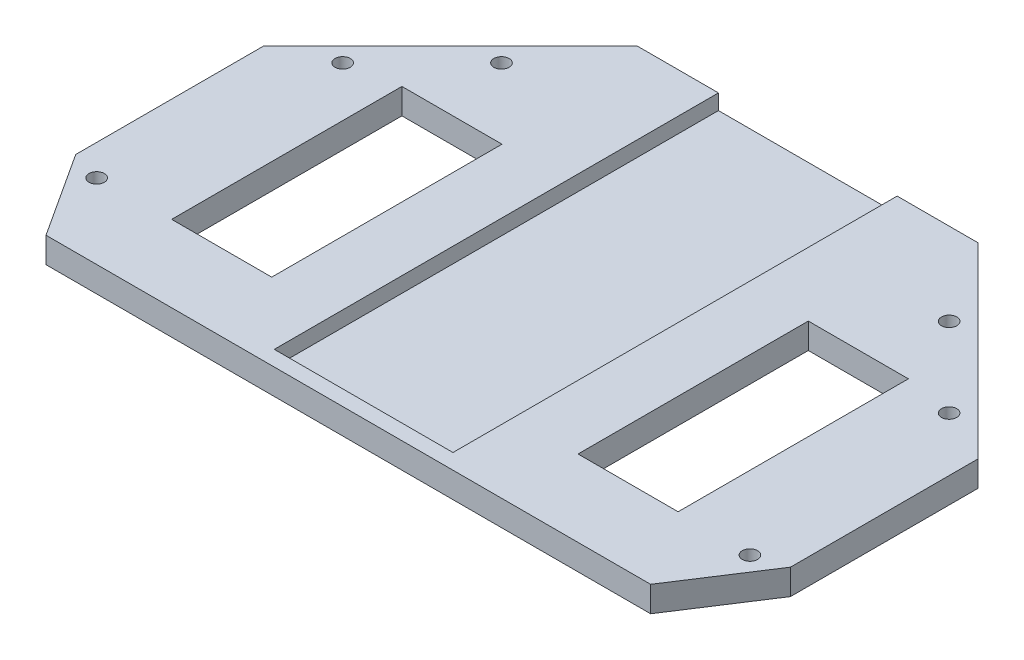
ISO-10303-21;
HEADER;
FILE_DESCRIPTION(('STEP AP214'),'2;1');
FILE_NAME('part.step','',(''),(''),'','','');
FILE_SCHEMA(('AUTOMOTIVE_DESIGN { 1 0 10303 214 1 1 1 1 }'));
ENDSEC;
DATA;
#1=APPLICATION_CONTEXT('core data for automotive mechanical design processes');
#2=APPLICATION_PROTOCOL_DEFINITION('international standard','automotive_design',2000,#1);
#3=PRODUCT_CONTEXT('',#1,'mechanical');
#4=PRODUCT('Part','Part','',(#3));
#5=PRODUCT_RELATED_PRODUCT_CATEGORY('part','',(#4));
#6=PRODUCT_DEFINITION_FORMATION('','',#4);
#7=PRODUCT_DEFINITION_CONTEXT('part definition',#1,'design');
#8=PRODUCT_DEFINITION('design','',#6,#7);
#9=PRODUCT_DEFINITION_SHAPE('','',#8);
#10=(LENGTH_UNIT() NAMED_UNIT(*) SI_UNIT(.MILLI.,.METRE.));
#11=(NAMED_UNIT(*) PLANE_ANGLE_UNIT() SI_UNIT($,.RADIAN.));
#12=(NAMED_UNIT(*) SI_UNIT($,.STERADIAN.) SOLID_ANGLE_UNIT());
#13=UNCERTAINTY_MEASURE_WITH_UNIT(LENGTH_MEASURE(1.E-05),#10,'distance_accuracy_value','');
#14=(GEOMETRIC_REPRESENTATION_CONTEXT(3) GLOBAL_UNCERTAINTY_ASSIGNED_CONTEXT((#13)) GLOBAL_UNIT_ASSIGNED_CONTEXT((#10,
#11,#12)) REPRESENTATION_CONTEXT('',''));
#15=CARTESIAN_POINT('',(0.,0.,0.));
#16=DIRECTION('',(0.,0.,1.));
#17=DIRECTION('',(1.,0.,0.));
#18=AXIS2_PLACEMENT_3D('',#15,#16,#17);
#19=CARTESIAN_POINT('',(0.,5.,0.));
#20=DIRECTION('',(0.,-1.,0.));
#21=DIRECTION('',(0.,0.,-1.));
#22=AXIS2_PLACEMENT_3D('',#19,#20,#21);
#23=PLANE('',#22);
#24=CARTESIAN_POINT('',(-59.3969696196701,5.,-28.2842712474616));
#25=DIRECTION('',(0.,1.,0.));
#26=DIRECTION('',(0.,0.,1.));
#27=AXIS2_PLACEMENT_3D('',#24,#25,#26);
#28=CIRCLE('',#27,1.50000000000001);
#29=CARTESIAN_POINT('',(-59.3969696196701,5.,-26.7842712474616));
#30=VERTEX_POINT('',#29);
#31=EDGE_CURVE('E290',#30,#30,#28,.T.);
#32=ORIENTED_EDGE('',*,*,#31,.F.);
#33=EDGE_LOOP('',(#32));
#34=FACE_BOUND('',#33,.T.);
#35=DIRECTION('',(0.,0.,1.));
#36=VECTOR('',#35,1.);
#37=CARTESIAN_POINT('',(-49.6,5.,-30.1));
#38=LINE('',#37,#36);
#39=CARTESIAN_POINT('',(-49.6,5.,-30.1));
#40=VERTEX_POINT('',#39);
#41=CARTESIAN_POINT('',(-49.6,5.,15.));
#42=VERTEX_POINT('',#41);
#43=EDGE_CURVE('E302',#40,#42,#38,.T.);
#44=ORIENTED_EDGE('',*,*,#43,.F.);
#45=DIRECTION('',(-1.,0.,0.));
#46=VECTOR('',#45,1.);
#47=CARTESIAN_POINT('',(-49.6,5.,-30.1));
#48=LINE('',#47,#46);
#49=CARTESIAN_POINT('',(-30.,5.,-30.1));
#50=VERTEX_POINT('',#49);
#51=EDGE_CURVE('E309',#50,#40,#48,.T.);
#52=ORIENTED_EDGE('',*,*,#51,.F.);
#53=DIRECTION('',(0.,0.,-1.));
#54=VECTOR('',#53,1.);
#55=CARTESIAN_POINT('',(-30.,5.,-30.1));
#56=LINE('',#55,#54);
#57=CARTESIAN_POINT('',(-30.,5.,15.));
#58=VERTEX_POINT('',#57);
#59=EDGE_CURVE('E307',#58,#50,#56,.T.);
#60=ORIENTED_EDGE('',*,*,#59,.F.);
#61=DIRECTION('',(1.,0.,0.));
#62=VECTOR('',#61,1.);
#63=CARTESIAN_POINT('',(-49.6,5.,15.));
#64=LINE('',#63,#62);
#65=EDGE_CURVE('E304',#42,#58,#64,.T.);
#66=ORIENTED_EDGE('',*,*,#65,.F.);
#67=EDGE_LOOP('',(#44,#52,#60,#66));
#68=FACE_BOUND('',#67,.T.);
#69=DIRECTION('',(1.,0.,0.));
#70=VECTOR('',#69,1.);
#71=CARTESIAN_POINT('',(-17.5,5.,27.));
#72=LINE('',#71,#70);
#73=CARTESIAN_POINT('',(-17.5,5.,27.));
#74=VERTEX_POINT('',#73);
#75=CARTESIAN_POINT('',(17.5,5.,27.));
#76=VERTEX_POINT('',#75);
#77=EDGE_CURVE('E192',#74,#76,#72,.T.);
#78=ORIENTED_EDGE('',*,*,#77,.F.);
#79=DIRECTION('',(0.,0.,1.));
#80=VECTOR('',#79,1.);
#81=CARTESIAN_POINT('',(-17.5,5.,-60.));
#82=LINE('',#81,#80);
#83=CARTESIAN_POINT('',(-17.5,5.,-60.));
#84=VERTEX_POINT('',#83);
#85=EDGE_CURVE('E177',#84,#74,#82,.T.);
#86=ORIENTED_EDGE('',*,*,#85,.F.);
#87=DIRECTION('',(-1.,0.,0.));
#88=VECTOR('',#87,1.);
#89=CARTESIAN_POINT('',(-33.3380951166243,5.,-60.));
#90=LINE('',#89,#88);
#91=CARTESIAN_POINT('',(-33.3380951166243,5.,-60.));
#92=VERTEX_POINT('',#91);
#93=EDGE_CURVE('E333',#84,#92,#90,.T.);
#94=ORIENTED_EDGE('',*,*,#93,.T.);
#95=DIRECTION('',(-0.707106781186543,0.,0.707106781186552));
#96=VECTOR('',#95,1.);
#97=CARTESIAN_POINT('',(-70.,5.,-23.3380951166239));
#98=LINE('',#97,#96);
#99=CARTESIAN_POINT('',(-70.,5.,-23.3380951166239));
#100=VERTEX_POINT('',#99);
#101=EDGE_CURVE('E338',#92,#100,#98,.T.);
#102=ORIENTED_EDGE('',*,*,#101,.T.);
#103=DIRECTION('',(0.,0.,1.));
#104=VECTOR('',#103,1.);
#105=CARTESIAN_POINT('',(-70.,5.,13.3906308122387));
#106=LINE('',#105,#104);
#107=CARTESIAN_POINT('',(-70.,5.,13.3906308122387));
#108=VERTEX_POINT('',#107);
#109=EDGE_CURVE('E340',#100,#108,#106,.T.);
#110=ORIENTED_EDGE('',*,*,#109,.T.);
#111=DIRECTION('',(0.544639035015023,0.,0.838670567945427));
#112=VECTOR('',#111,1.);
#113=CARTESIAN_POINT('',(-59.2137495312472,5.,30.));
#114=LINE('',#113,#112);
#115=CARTESIAN_POINT('',(-59.2137495312472,5.,30.));
#116=VERTEX_POINT('',#115);
#117=EDGE_CURVE('E342',#108,#116,#114,.T.);
#118=ORIENTED_EDGE('',*,*,#117,.T.);
#119=DIRECTION('',(1.,0.,0.));
#120=VECTOR('',#119,1.);
#121=CARTESIAN_POINT('',(0.,5.,30.));
#122=LINE('',#121,#120);
#123=CARTESIAN_POINT('',(59.2137495312472,5.,30.));
#124=VERTEX_POINT('',#123);
#125=EDGE_CURVE('E331',#116,#124,#122,.T.);
#126=ORIENTED_EDGE('',*,*,#125,.T.);
#127=DIRECTION('',(-0.544639035015023,0.,0.838670567945427));
#128=VECTOR('',#127,1.);
#129=CARTESIAN_POINT('',(59.2137495312472,5.,30.));
#130=LINE('',#129,#128);
#131=CARTESIAN_POINT('',(70.,5.,13.3906308122387));
#132=VERTEX_POINT('',#131);
#133=EDGE_CURVE('E256',#132,#124,#130,.T.);
#134=ORIENTED_EDGE('',*,*,#133,.F.);
#135=DIRECTION('',(0.,0.,1.));
#136=VECTOR('',#135,1.);
#137=CARTESIAN_POINT('',(70.,5.,13.3906308122387));
#138=LINE('',#137,#136);
#139=CARTESIAN_POINT('',(70.,5.,-23.3380951166239));
#140=VERTEX_POINT('',#139);
#141=EDGE_CURVE('E259',#140,#132,#138,.T.);
#142=ORIENTED_EDGE('',*,*,#141,.F.);
#143=DIRECTION('',(0.707106781186543,0.,0.707106781186552));
#144=VECTOR('',#143,1.);
#145=CARTESIAN_POINT('',(70.,5.,-23.3380951166239));
#146=LINE('',#145,#144);
#147=CARTESIAN_POINT('',(33.3380951166243,5.,-60.));
#148=VERTEX_POINT('',#147);
#149=EDGE_CURVE('E263',#148,#140,#146,.T.);
#150=ORIENTED_EDGE('',*,*,#149,.F.);
#151=CARTESIAN_POINT('',(17.5,5.,-60.));
#152=VERTEX_POINT('',#151);
#153=EDGE_CURVE('E335',#148,#152,#90,.T.);
#154=ORIENTED_EDGE('',*,*,#153,.T.);
#155=DIRECTION('',(0.,0.,-1.));
#156=VECTOR('',#155,1.);
#157=CARTESIAN_POINT('',(17.5,5.,-60.));
#158=LINE('',#157,#156);
#159=EDGE_CURVE('E190',#76,#152,#158,.T.);
#160=ORIENTED_EDGE('',*,*,#159,.F.);
#161=EDGE_LOOP('',(#78,#86,#94,#102,#110,#118,#126,#134,#142,#150,#154,#160));
#162=FACE_BOUND('',#161,.T.);
#163=CARTESIAN_POINT('',(-43.8406204335662,5.,-43.8406204335657));
#164=DIRECTION('',(0.,1.,0.));
#165=DIRECTION('',(0.,0.,1.));
#166=AXIS2_PLACEMENT_3D('',#163,#164,#165);
#167=CIRCLE('',#166,1.50000000000001);
#168=CARTESIAN_POINT('',(-43.8406204335662,5.,-42.3406204335657));
#169=VERTEX_POINT('',#168);
#170=EDGE_CURVE('E296',#169,#169,#167,.T.);
#171=ORIENTED_EDGE('',*,*,#170,.F.);
#172=EDGE_LOOP('',(#171));
#173=FACE_BOUND('',#172,.T.);
#174=CARTESIAN_POINT('',(-63.979633982947,5.,15.316867676132));
#175=DIRECTION('',(0.,1.,0.));
#176=DIRECTION('',(0.,0.,1.));
#177=AXIS2_PLACEMENT_3D('',#174,#175,#176);
#178=CIRCLE('',#177,1.50000000000001);
#179=CARTESIAN_POINT('',(-63.979633982947,5.,16.816867676132));
#180=VERTEX_POINT('',#179);
#181=EDGE_CURVE('E284',#180,#180,#178,.T.);
#182=ORIENTED_EDGE('',*,*,#181,.F.);
#183=EDGE_LOOP('',(#182));
#184=FACE_BOUND('',#183,.T.);
#185=CARTESIAN_POINT('',(63.979633982947,5.,15.316867676132));
#186=DIRECTION('',(0.,-1.,0.));
#187=DIRECTION('',(0.,0.,1.));
#188=AXIS2_PLACEMENT_3D('',#185,#186,#187);
#189=CIRCLE('',#188,1.50000000000001);
#190=CARTESIAN_POINT('',(63.979633982947,5.,16.816867676132));
#191=VERTEX_POINT('',#190);
#192=EDGE_CURVE('E206',#191,#191,#189,.T.);
#193=ORIENTED_EDGE('',*,*,#192,.T.);
#194=EDGE_LOOP('',(#193));
#195=FACE_BOUND('',#194,.T.);
#196=CARTESIAN_POINT('',(59.3969696196701,5.,-28.2842712474616));
#197=DIRECTION('',(0.,-1.,0.));
#198=DIRECTION('',(0.,0.,1.));
#199=AXIS2_PLACEMENT_3D('',#196,#197,#198);
#200=CIRCLE('',#199,1.50000000000001);
#201=CARTESIAN_POINT('',(59.3969696196701,5.,-26.7842712474616));
#202=VERTEX_POINT('',#201);
#203=EDGE_CURVE('E212',#202,#202,#200,.T.);
#204=ORIENTED_EDGE('',*,*,#203,.T.);
#205=EDGE_LOOP('',(#204));
#206=FACE_BOUND('',#205,.T.);
#207=CARTESIAN_POINT('',(43.8406204335662,5.,-43.8406204335657));
#208=DIRECTION('',(0.,-1.,0.));
#209=DIRECTION('',(0.,0.,1.));
#210=AXIS2_PLACEMENT_3D('',#207,#208,#209);
#211=CIRCLE('',#210,1.50000000000001);
#212=CARTESIAN_POINT('',(43.8406204335662,5.,-42.3406204335657));
#213=VERTEX_POINT('',#212);
#214=EDGE_CURVE('E218',#213,#213,#211,.T.);
#215=ORIENTED_EDGE('',*,*,#214,.T.);
#216=EDGE_LOOP('',(#215));
#217=FACE_BOUND('',#216,.T.);
#218=DIRECTION('',(1.,0.,0.));
#219=VECTOR('',#218,1.);
#220=CARTESIAN_POINT('',(49.6,5.,-30.1));
#221=LINE('',#220,#219);
#222=CARTESIAN_POINT('',(30.,5.,-30.1));
#223=VERTEX_POINT('',#222);
#224=CARTESIAN_POINT('',(49.6,5.,-30.1));
#225=VERTEX_POINT('',#224);
#226=EDGE_CURVE('E227',#223,#225,#221,.T.);
#227=ORIENTED_EDGE('',*,*,#226,.T.);
#228=DIRECTION('',(0.,0.,1.));
#229=VECTOR('',#228,1.);
#230=CARTESIAN_POINT('',(49.6,5.,-30.1));
#231=LINE('',#230,#229);
#232=CARTESIAN_POINT('',(49.6,5.,15.));
#233=VERTEX_POINT('',#232);
#234=EDGE_CURVE('E224',#225,#233,#231,.T.);
#235=ORIENTED_EDGE('',*,*,#234,.T.);
#236=DIRECTION('',(-1.,0.,0.));
#237=VECTOR('',#236,1.);
#238=CARTESIAN_POINT('',(49.6,5.,15.));
#239=LINE('',#238,#237);
#240=CARTESIAN_POINT('',(30.,5.,15.));
#241=VERTEX_POINT('',#240);
#242=EDGE_CURVE('E234',#233,#241,#239,.T.);
#243=ORIENTED_EDGE('',*,*,#242,.T.);
#244=DIRECTION('',(0.,0.,-1.));
#245=VECTOR('',#244,1.);
#246=CARTESIAN_POINT('',(30.,5.,-30.1));
#247=LINE('',#246,#245);
#248=EDGE_CURVE('E231',#241,#223,#247,.T.);
#249=ORIENTED_EDGE('',*,*,#248,.T.);
#250=EDGE_LOOP('',(#227,#235,#243,#249));
#251=FACE_BOUND('',#250,.T.);
#252=ADVANCED_FACE('F33',(#34,#68,#162,#173,#184,#195,#206,#217,#251),#23,.F.);
#253=CARTESIAN_POINT('',(0.,0.,0.));
#254=DIRECTION('',(0.,-1.,0.));
#255=DIRECTION('',(0.,0.,-1.));
#256=AXIS2_PLACEMENT_3D('',#253,#254,#255);
#257=PLANE('',#256);
#258=CARTESIAN_POINT('',(-59.3969696196701,0.,-28.2842712474616));
#259=DIRECTION('',(0.,1.,0.));
#260=DIRECTION('',(0.,0.,1.));
#261=AXIS2_PLACEMENT_3D('',#258,#259,#260);
#262=CIRCLE('',#261,1.50000000000001);
#263=CARTESIAN_POINT('',(-59.3969696196701,0.,-26.7842712474616));
#264=VERTEX_POINT('',#263);
#265=EDGE_CURVE('E287',#264,#264,#262,.T.);
#266=ORIENTED_EDGE('',*,*,#265,.T.);
#267=EDGE_LOOP('',(#266));
#268=FACE_BOUND('',#267,.T.);
#269=DIRECTION('',(-1.,0.,0.));
#270=VECTOR('',#269,1.);
#271=CARTESIAN_POINT('',(-49.6,0.,-30.1));
#272=LINE('',#271,#270);
#273=CARTESIAN_POINT('',(-30.,0.,-30.1));
#274=VERTEX_POINT('',#273);
#275=CARTESIAN_POINT('',(-49.6,0.,-30.1));
#276=VERTEX_POINT('',#275);
#277=EDGE_CURVE('E305',#274,#276,#272,.T.);
#278=ORIENTED_EDGE('',*,*,#277,.T.);
#279=DIRECTION('',(0.,0.,1.));
#280=VECTOR('',#279,1.);
#281=CARTESIAN_POINT('',(-49.6,0.,-30.1));
#282=LINE('',#281,#280);
#283=CARTESIAN_POINT('',(-49.6,0.,15.));
#284=VERTEX_POINT('',#283);
#285=EDGE_CURVE('E299',#276,#284,#282,.T.);
#286=ORIENTED_EDGE('',*,*,#285,.T.);
#287=DIRECTION('',(1.,0.,0.));
#288=VECTOR('',#287,1.);
#289=CARTESIAN_POINT('',(-49.6,0.,15.));
#290=LINE('',#289,#288);
#291=CARTESIAN_POINT('',(-30.,0.,15.));
#292=VERTEX_POINT('',#291);
#293=EDGE_CURVE('E314',#284,#292,#290,.T.);
#294=ORIENTED_EDGE('',*,*,#293,.T.);
#295=DIRECTION('',(0.,0.,-1.));
#296=VECTOR('',#295,1.);
#297=CARTESIAN_POINT('',(-30.,0.,-30.1));
#298=LINE('',#297,#296);
#299=EDGE_CURVE('E317',#292,#274,#298,.T.);
#300=ORIENTED_EDGE('',*,*,#299,.T.);
#301=EDGE_LOOP('',(#278,#286,#294,#300));
#302=FACE_BOUND('',#301,.T.);
#303=DIRECTION('',(1.,0.,0.));
#304=VECTOR('',#303,1.);
#305=CARTESIAN_POINT('',(0.,0.,30.));
#306=LINE('',#305,#304);
#307=CARTESIAN_POINT('',(-59.2137495312472,0.,30.));
#308=VERTEX_POINT('',#307);
#309=CARTESIAN_POINT('',(59.2137495312472,0.,30.));
#310=VERTEX_POINT('',#309);
#311=EDGE_CURVE('E330',#308,#310,#306,.T.);
#312=ORIENTED_EDGE('',*,*,#311,.F.);
#313=DIRECTION('',(0.544639035015023,0.,0.838670567945427));
#314=VECTOR('',#313,1.);
#315=CARTESIAN_POINT('',(-59.2137495312472,0.,30.));
#316=LINE('',#315,#314);
#317=CARTESIAN_POINT('',(-70.,0.,13.3906308122387));
#318=VERTEX_POINT('',#317);
#319=EDGE_CURVE('E334',#318,#308,#316,.T.);
#320=ORIENTED_EDGE('',*,*,#319,.F.);
#321=DIRECTION('',(0.,0.,1.));
#322=VECTOR('',#321,1.);
#323=CARTESIAN_POINT('',(-70.,0.,13.3906308122387));
#324=LINE('',#323,#322);
#325=CARTESIAN_POINT('',(-70.,0.,-23.3380951166239));
#326=VERTEX_POINT('',#325);
#327=EDGE_CURVE('E350',#326,#318,#324,.T.);
#328=ORIENTED_EDGE('',*,*,#327,.F.);
#329=DIRECTION('',(-0.707106781186543,0.,0.707106781186552));
#330=VECTOR('',#329,1.);
#331=CARTESIAN_POINT('',(-70.,0.,-23.3380951166239));
#332=LINE('',#331,#330);
#333=CARTESIAN_POINT('',(-33.3380951166243,0.,-60.));
#334=VERTEX_POINT('',#333);
#335=EDGE_CURVE('E348',#334,#326,#332,.T.);
#336=ORIENTED_EDGE('',*,*,#335,.F.);
#337=DIRECTION('',(-1.,0.,0.));
#338=VECTOR('',#337,1.);
#339=CARTESIAN_POINT('',(-33.3380951166243,0.,-60.));
#340=LINE('',#339,#338);
#341=CARTESIAN_POINT('',(33.3380951166243,0.,-60.));
#342=VERTEX_POINT('',#341);
#343=EDGE_CURVE('E346',#342,#334,#340,.T.);
#344=ORIENTED_EDGE('',*,*,#343,.F.);
#345=DIRECTION('',(0.707106781186543,0.,0.707106781186552));
#346=VECTOR('',#345,1.);
#347=CARTESIAN_POINT('',(70.,0.,-23.3380951166239));
#348=LINE('',#347,#346);
#349=CARTESIAN_POINT('',(70.,0.,-23.3380951166239));
#350=VERTEX_POINT('',#349);
#351=EDGE_CURVE('E260',#342,#350,#348,.T.);
#352=ORIENTED_EDGE('',*,*,#351,.T.);
#353=DIRECTION('',(0.,0.,1.));
#354=VECTOR('',#353,1.);
#355=CARTESIAN_POINT('',(70.,0.,13.3906308122387));
#356=LINE('',#355,#354);
#357=CARTESIAN_POINT('',(70.,0.,13.3906308122387));
#358=VERTEX_POINT('',#357);
#359=EDGE_CURVE('E269',#350,#358,#356,.T.);
#360=ORIENTED_EDGE('',*,*,#359,.T.);
#361=DIRECTION('',(-0.544639035015023,0.,0.838670567945427));
#362=VECTOR('',#361,1.);
#363=CARTESIAN_POINT('',(59.2137495312472,0.,30.));
#364=LINE('',#363,#362);
#365=EDGE_CURVE('E255',#358,#310,#364,.T.);
#366=ORIENTED_EDGE('',*,*,#365,.T.);
#367=EDGE_LOOP('',(#312,#320,#328,#336,#344,#352,#360,#366));
#368=FACE_BOUND('',#367,.T.);
#369=CARTESIAN_POINT('',(-43.8406204335662,0.,-43.8406204335657));
#370=DIRECTION('',(0.,1.,0.));
#371=DIRECTION('',(0.,0.,1.));
#372=AXIS2_PLACEMENT_3D('',#369,#370,#371);
#373=CIRCLE('',#372,1.50000000000001);
#374=CARTESIAN_POINT('',(-43.8406204335662,0.,-42.3406204335657));
#375=VERTEX_POINT('',#374);
#376=EDGE_CURVE('E293',#375,#375,#373,.T.);
#377=ORIENTED_EDGE('',*,*,#376,.T.);
#378=EDGE_LOOP('',(#377));
#379=FACE_BOUND('',#378,.T.);
#380=CARTESIAN_POINT('',(-63.979633982947,0.,15.316867676132));
#381=DIRECTION('',(0.,1.,0.));
#382=DIRECTION('',(0.,0.,1.));
#383=AXIS2_PLACEMENT_3D('',#380,#381,#382);
#384=CIRCLE('',#383,1.50000000000001);
#385=CARTESIAN_POINT('',(-63.979633982947,0.,16.816867676132));
#386=VERTEX_POINT('',#385);
#387=EDGE_CURVE('E283',#386,#386,#384,.T.);
#388=ORIENTED_EDGE('',*,*,#387,.T.);
#389=EDGE_LOOP('',(#388));
#390=FACE_BOUND('',#389,.T.);
#391=CARTESIAN_POINT('',(63.979633982947,0.,15.316867676132));
#392=DIRECTION('',(0.,-1.,0.));
#393=DIRECTION('',(0.,0.,1.));
#394=AXIS2_PLACEMENT_3D('',#391,#392,#393);
#395=CIRCLE('',#394,1.50000000000001);
#396=CARTESIAN_POINT('',(63.979633982947,0.,16.816867676132));
#397=VERTEX_POINT('',#396);
#398=EDGE_CURVE('E201',#397,#397,#395,.T.);
#399=ORIENTED_EDGE('',*,*,#398,.F.);
#400=EDGE_LOOP('',(#399));
#401=FACE_BOUND('',#400,.T.);
#402=CARTESIAN_POINT('',(59.3969696196701,0.,-28.2842712474616));
#403=DIRECTION('',(0.,-1.,0.));
#404=DIRECTION('',(0.,0.,1.));
#405=AXIS2_PLACEMENT_3D('',#402,#403,#404);
#406=CIRCLE('',#405,1.50000000000001);
#407=CARTESIAN_POINT('',(59.3969696196701,0.,-26.7842712474616));
#408=VERTEX_POINT('',#407);
#409=EDGE_CURVE('E209',#408,#408,#406,.T.);
#410=ORIENTED_EDGE('',*,*,#409,.F.);
#411=EDGE_LOOP('',(#410));
#412=FACE_BOUND('',#411,.T.);
#413=CARTESIAN_POINT('',(43.8406204335662,0.,-43.8406204335657));
#414=DIRECTION('',(0.,-1.,0.));
#415=DIRECTION('',(0.,0.,1.));
#416=AXIS2_PLACEMENT_3D('',#413,#414,#415);
#417=CIRCLE('',#416,1.50000000000001);
#418=CARTESIAN_POINT('',(43.8406204335662,0.,-42.3406204335657));
#419=VERTEX_POINT('',#418);
#420=EDGE_CURVE('E215',#419,#419,#417,.T.);
#421=ORIENTED_EDGE('',*,*,#420,.F.);
#422=EDGE_LOOP('',(#421));
#423=FACE_BOUND('',#422,.T.);
#424=DIRECTION('',(0.,0.,1.));
#425=VECTOR('',#424,1.);
#426=CARTESIAN_POINT('',(49.6,0.,-30.1));
#427=LINE('',#426,#425);
#428=CARTESIAN_POINT('',(49.6,0.,-30.1));
#429=VERTEX_POINT('',#428);
#430=CARTESIAN_POINT('',(49.6,0.,15.));
#431=VERTEX_POINT('',#430);
#432=EDGE_CURVE('E221',#429,#431,#427,.T.);
#433=ORIENTED_EDGE('',*,*,#432,.F.);
#434=DIRECTION('',(1.,0.,0.));
#435=VECTOR('',#434,1.);
#436=CARTESIAN_POINT('',(49.6,0.,-30.1));
#437=LINE('',#436,#435);
#438=CARTESIAN_POINT('',(30.,0.,-30.1));
#439=VERTEX_POINT('',#438);
#440=EDGE_CURVE('E239',#439,#429,#437,.T.);
#441=ORIENTED_EDGE('',*,*,#440,.F.);
#442=DIRECTION('',(0.,0.,-1.));
#443=VECTOR('',#442,1.);
#444=CARTESIAN_POINT('',(30.,0.,-30.1));
#445=LINE('',#444,#443);
#446=CARTESIAN_POINT('',(30.,0.,15.));
#447=VERTEX_POINT('',#446);
#448=EDGE_CURVE('E242',#447,#439,#445,.T.);
#449=ORIENTED_EDGE('',*,*,#448,.F.);
#450=DIRECTION('',(-1.,0.,0.));
#451=VECTOR('',#450,1.);
#452=CARTESIAN_POINT('',(49.6,0.,15.));
#453=LINE('',#452,#451);
#454=EDGE_CURVE('E228',#431,#447,#453,.T.);
#455=ORIENTED_EDGE('',*,*,#454,.F.);
#456=EDGE_LOOP('',(#433,#441,#449,#455));
#457=FACE_BOUND('',#456,.T.);
#458=ADVANCED_FACE('F370',(#268,#302,#368,#379,#390,#401,#412,#423,#457),#257,.T.);
#459=CARTESIAN_POINT('',(0.,5.,30.));
#460=DIRECTION('',(0.,0.,-1.));
#461=DIRECTION('',(-1.,0.,0.));
#462=AXIS2_PLACEMENT_3D('',#459,#460,#461);
#463=PLANE('',#462);
#464=ORIENTED_EDGE('',*,*,#311,.T.);
#465=DIRECTION('',(0.,-1.,0.));
#466=VECTOR('',#465,1.);
#467=CARTESIAN_POINT('',(59.2137495312472,5.,30.));
#468=LINE('',#467,#466);
#469=EDGE_CURVE('E280',#124,#310,#468,.T.);
#470=ORIENTED_EDGE('',*,*,#469,.F.);
#471=ORIENTED_EDGE('',*,*,#125,.F.);
#472=DIRECTION('',(0.,-1.,0.));
#473=VECTOR('',#472,1.);
#474=CARTESIAN_POINT('',(-59.2137495312472,5.,30.));
#475=LINE('',#474,#473);
#476=EDGE_CURVE('E344',#116,#308,#475,.T.);
#477=ORIENTED_EDGE('',*,*,#476,.T.);
#478=EDGE_LOOP('',(#464,#470,#471,#477));
#479=FACE_BOUND('',#478,.T.);
#480=ADVANCED_FACE('F35',(#479),#463,.F.);
#481=CARTESIAN_POINT('',(-33.3380951166243,5.,-60.));
#482=DIRECTION('',(0.,0.,1.));
#483=DIRECTION('',(1.,0.,0.));
#484=AXIS2_PLACEMENT_3D('',#481,#482,#483);
#485=PLANE('',#484);
#486=ORIENTED_EDGE('',*,*,#93,.F.);
#487=DIRECTION('',(0.,1.,0.));
#488=VECTOR('',#487,1.);
#489=CARTESIAN_POINT('',(-17.5,2.,-60.));
#490=LINE('',#489,#488);
#491=CARTESIAN_POINT('',(-17.5,2.,-60.));
#492=VERTEX_POINT('',#491);
#493=EDGE_CURVE('E199',#492,#84,#490,.T.);
#494=ORIENTED_EDGE('',*,*,#493,.F.);
#495=DIRECTION('',(-1.,0.,0.));
#496=VECTOR('',#495,1.);
#497=CARTESIAN_POINT('',(-17.5,2.,-60.));
#498=LINE('',#497,#496);
#499=CARTESIAN_POINT('',(17.5,2.,-60.));
#500=VERTEX_POINT('',#499);
#501=EDGE_CURVE('E182',#500,#492,#498,.T.);
#502=ORIENTED_EDGE('',*,*,#501,.F.);
#503=DIRECTION('',(0.,1.,0.));
#504=VECTOR('',#503,1.);
#505=CARTESIAN_POINT('',(17.5,2.,-60.));
#506=LINE('',#505,#504);
#507=EDGE_CURVE('E202',#500,#152,#506,.T.);
#508=ORIENTED_EDGE('',*,*,#507,.T.);
#509=ORIENTED_EDGE('',*,*,#153,.F.);
#510=DIRECTION('',(0.,-1.,0.));
#511=VECTOR('',#510,1.);
#512=CARTESIAN_POINT('',(33.3380951166243,5.,-60.));
#513=LINE('',#512,#511);
#514=EDGE_CURVE('E266',#148,#342,#513,.T.);
#515=ORIENTED_EDGE('',*,*,#514,.T.);
#516=ORIENTED_EDGE('',*,*,#343,.T.);
#517=DIRECTION('',(0.,-1.,0.));
#518=VECTOR('',#517,1.);
#519=CARTESIAN_POINT('',(-33.3380951166243,5.,-60.));
#520=LINE('',#519,#518);
#521=EDGE_CURVE('E11',#92,#334,#520,.T.);
#522=ORIENTED_EDGE('',*,*,#521,.F.);
#523=EDGE_LOOP('',(#486,#494,#502,#508,#509,#515,#516,#522));
#524=FACE_BOUND('',#523,.T.);
#525=ADVANCED_FACE('F387',(#524),#485,.F.);
#526=CARTESIAN_POINT('',(-70.,5.,-23.3380951166239));
#527=DIRECTION('',(0.707106781186552,0.,0.707106781186543));
#528=DIRECTION('',(0.707106781186543,0.,-0.707106781186552));
#529=AXIS2_PLACEMENT_3D('',#526,#527,#528);
#530=PLANE('',#529);
#531=ORIENTED_EDGE('',*,*,#335,.T.);
#532=DIRECTION('',(0.,-1.,0.));
#533=VECTOR('',#532,1.);
#534=CARTESIAN_POINT('',(-70.,5.,-23.3380951166239));
#535=LINE('',#534,#533);
#536=EDGE_CURVE('E41',#100,#326,#535,.T.);
#537=ORIENTED_EDGE('',*,*,#536,.F.);
#538=ORIENTED_EDGE('',*,*,#101,.F.);
#539=ORIENTED_EDGE('',*,*,#521,.T.);
#540=EDGE_LOOP('',(#531,#537,#538,#539));
#541=FACE_BOUND('',#540,.T.);
#542=ADVANCED_FACE('F385',(#541),#530,.F.);
#543=CARTESIAN_POINT('',(-70.,5.,13.3906308122387));
#544=DIRECTION('',(1.,0.,0.));
#545=DIRECTION('',(0.,0.,-1.));
#546=AXIS2_PLACEMENT_3D('',#543,#544,#545);
#547=PLANE('',#546);
#548=ORIENTED_EDGE('',*,*,#327,.T.);
#549=DIRECTION('',(0.,-1.,0.));
#550=VECTOR('',#549,1.);
#551=CARTESIAN_POINT('',(-70.,5.,13.3906308122387));
#552=LINE('',#551,#550);
#553=EDGE_CURVE('E355',#108,#318,#552,.T.);
#554=ORIENTED_EDGE('',*,*,#553,.F.);
#555=ORIENTED_EDGE('',*,*,#109,.F.);
#556=ORIENTED_EDGE('',*,*,#536,.T.);
#557=EDGE_LOOP('',(#548,#554,#555,#556));
#558=FACE_BOUND('',#557,.T.);
#559=ADVANCED_FACE('F362',(#558),#547,.F.);
#560=CARTESIAN_POINT('',(-59.2137495312472,5.,30.));
#561=DIRECTION('',(0.838670567945427,0.,-0.544639035015023));
#562=DIRECTION('',(-0.544639035015023,0.,-0.838670567945427));
#563=AXIS2_PLACEMENT_3D('',#560,#561,#562);
#564=PLANE('',#563);
#565=ORIENTED_EDGE('',*,*,#319,.T.);
#566=ORIENTED_EDGE('',*,*,#476,.F.);
#567=ORIENTED_EDGE('',*,*,#117,.F.);
#568=ORIENTED_EDGE('',*,*,#553,.T.);
#569=EDGE_LOOP('',(#565,#566,#567,#568));
#570=FACE_BOUND('',#569,.T.);
#571=ADVANCED_FACE('F374',(#570),#564,.F.);
#572=CARTESIAN_POINT('',(-49.6,5.,-30.1));
#573=DIRECTION('',(1.,0.,0.));
#574=DIRECTION('',(0.,0.,-1.));
#575=AXIS2_PLACEMENT_3D('',#572,#573,#574);
#576=PLANE('',#575);
#577=ORIENTED_EDGE('',*,*,#285,.F.);
#578=DIRECTION('',(0.,-1.,0.));
#579=VECTOR('',#578,1.);
#580=CARTESIAN_POINT('',(-49.6,5.,-30.1));
#581=LINE('',#580,#579);
#582=EDGE_CURVE('E311',#40,#276,#581,.T.);
#583=ORIENTED_EDGE('',*,*,#582,.F.);
#584=ORIENTED_EDGE('',*,*,#43,.T.);
#585=DIRECTION('',(0.,-1.,0.));
#586=VECTOR('',#585,1.);
#587=CARTESIAN_POINT('',(-49.6,5.,15.));
#588=LINE('',#587,#586);
#589=EDGE_CURVE('E327',#42,#284,#588,.T.);
#590=ORIENTED_EDGE('',*,*,#589,.T.);
#591=EDGE_LOOP('',(#577,#583,#584,#590));
#592=FACE_BOUND('',#591,.T.);
#593=ADVANCED_FACE('F421',(#592),#576,.T.);
#594=CARTESIAN_POINT('',(-49.6,5.,15.));
#595=DIRECTION('',(0.,0.,-1.));
#596=DIRECTION('',(-1.,0.,0.));
#597=AXIS2_PLACEMENT_3D('',#594,#595,#596);
#598=PLANE('',#597);
#599=ORIENTED_EDGE('',*,*,#293,.F.);
#600=ORIENTED_EDGE('',*,*,#589,.F.);
#601=ORIENTED_EDGE('',*,*,#65,.T.);
#602=DIRECTION('',(0.,-1.,0.));
#603=VECTOR('',#602,1.);
#604=CARTESIAN_POINT('',(-30.,5.,15.));
#605=LINE('',#604,#603);
#606=EDGE_CURVE('E325',#58,#292,#605,.T.);
#607=ORIENTED_EDGE('',*,*,#606,.T.);
#608=EDGE_LOOP('',(#599,#600,#601,#607));
#609=FACE_BOUND('',#608,.T.);
#610=ADVANCED_FACE('F485',(#609),#598,.T.);
#611=CARTESIAN_POINT('',(-30.,5.,-30.1));
#612=DIRECTION('',(-1.,0.,0.));
#613=DIRECTION('',(0.,0.,1.));
#614=AXIS2_PLACEMENT_3D('',#611,#612,#613);
#615=PLANE('',#614);
#616=ORIENTED_EDGE('',*,*,#299,.F.);
#617=ORIENTED_EDGE('',*,*,#606,.F.);
#618=ORIENTED_EDGE('',*,*,#59,.T.);
#619=DIRECTION('',(0.,-1.,0.));
#620=VECTOR('',#619,1.);
#621=CARTESIAN_POINT('',(-30.,5.,-30.1));
#622=LINE('',#621,#620);
#623=EDGE_CURVE('E56',#50,#274,#622,.T.);
#624=ORIENTED_EDGE('',*,*,#623,.T.);
#625=EDGE_LOOP('',(#616,#617,#618,#624));
#626=FACE_BOUND('',#625,.T.);
#627=ADVANCED_FACE('F476',(#626),#615,.T.);
#628=CARTESIAN_POINT('',(-49.6,5.,-30.1));
#629=DIRECTION('',(0.,0.,1.));
#630=DIRECTION('',(1.,0.,0.));
#631=AXIS2_PLACEMENT_3D('',#628,#629,#630);
#632=PLANE('',#631);
#633=ORIENTED_EDGE('',*,*,#277,.F.);
#634=ORIENTED_EDGE('',*,*,#623,.F.);
#635=ORIENTED_EDGE('',*,*,#51,.T.);
#636=ORIENTED_EDGE('',*,*,#582,.T.);
#637=EDGE_LOOP('',(#633,#634,#635,#636));
#638=FACE_BOUND('',#637,.T.);
#639=ADVANCED_FACE('F466',(#638),#632,.T.);
#640=CARTESIAN_POINT('',(-43.8406204335662,5.,-43.8406204335657));
#641=DIRECTION('',(0.,-1.,0.));
#642=DIRECTION('',(0.,0.,-1.));
#643=AXIS2_PLACEMENT_3D('',#640,#641,#642);
#644=CYLINDRICAL_SURFACE('',#643,1.50000000000001);
#645=ORIENTED_EDGE('',*,*,#170,.T.);
#646=EDGE_LOOP('',(#645));
#647=FACE_BOUND('',#646,.T.);
#648=ORIENTED_EDGE('',*,*,#376,.F.);
#649=EDGE_LOOP('',(#648));
#650=FACE_BOUND('',#649,.T.);
#651=ADVANCED_FACE('F456',(#647,#650),#644,.F.);
#652=CARTESIAN_POINT('',(-59.3969696196701,5.,-28.2842712474616));
#653=DIRECTION('',(0.,-1.,0.));
#654=DIRECTION('',(0.,0.,-1.));
#655=AXIS2_PLACEMENT_3D('',#652,#653,#654);
#656=CYLINDRICAL_SURFACE('',#655,1.50000000000001);
#657=ORIENTED_EDGE('',*,*,#31,.T.);
#658=EDGE_LOOP('',(#657));
#659=FACE_BOUND('',#658,.T.);
#660=ORIENTED_EDGE('',*,*,#265,.F.);
#661=EDGE_LOOP('',(#660));
#662=FACE_BOUND('',#661,.T.);
#663=ADVANCED_FACE('F407',(#659,#662),#656,.F.);
#664=CARTESIAN_POINT('',(-63.979633982947,5.,15.316867676132));
#665=DIRECTION('',(0.,-1.,0.));
#666=DIRECTION('',(0.,0.,-1.));
#667=AXIS2_PLACEMENT_3D('',#664,#665,#666);
#668=CYLINDRICAL_SURFACE('',#667,1.50000000000001);
#669=ORIENTED_EDGE('',*,*,#181,.T.);
#670=EDGE_LOOP('',(#669));
#671=FACE_BOUND('',#670,.T.);
#672=ORIENTED_EDGE('',*,*,#387,.F.);
#673=EDGE_LOOP('',(#672));
#674=FACE_BOUND('',#673,.T.);
#675=ADVANCED_FACE('F400',(#671,#674),#668,.F.);
#676=CARTESIAN_POINT('',(59.2137495312472,5.,30.));
#677=DIRECTION('',(0.838670567945427,0.,0.544639035015023));
#678=DIRECTION('',(0.544639035015023,0.,-0.838670567945427));
#679=AXIS2_PLACEMENT_3D('',#676,#677,#678);
#680=PLANE('',#679);
#681=ORIENTED_EDGE('',*,*,#365,.F.);
#682=DIRECTION('',(0.,-1.,0.));
#683=VECTOR('',#682,1.);
#684=CARTESIAN_POINT('',(70.,5.,13.3906308122387));
#685=LINE('',#684,#683);
#686=EDGE_CURVE('E278',#132,#358,#685,.T.);
#687=ORIENTED_EDGE('',*,*,#686,.F.);
#688=ORIENTED_EDGE('',*,*,#133,.T.);
#689=ORIENTED_EDGE('',*,*,#469,.T.);
#690=EDGE_LOOP('',(#681,#687,#688,#689));
#691=FACE_BOUND('',#690,.T.);
#692=ADVANCED_FACE('F398',(#691),#680,.T.);
#693=CARTESIAN_POINT('',(70.,5.,13.3906308122387));
#694=DIRECTION('',(1.,0.,0.));
#695=DIRECTION('',(0.,0.,-1.));
#696=AXIS2_PLACEMENT_3D('',#693,#694,#695);
#697=PLANE('',#696);
#698=ORIENTED_EDGE('',*,*,#359,.F.);
#699=DIRECTION('',(0.,-1.,0.));
#700=VECTOR('',#699,1.);
#701=CARTESIAN_POINT('',(70.,5.,-23.3380951166239));
#702=LINE('',#701,#700);
#703=EDGE_CURVE('E276',#140,#350,#702,.T.);
#704=ORIENTED_EDGE('',*,*,#703,.F.);
#705=ORIENTED_EDGE('',*,*,#141,.T.);
#706=ORIENTED_EDGE('',*,*,#686,.T.);
#707=EDGE_LOOP('',(#698,#704,#705,#706));
#708=FACE_BOUND('',#707,.T.);
#709=ADVANCED_FACE('F395',(#708),#697,.T.);
#710=CARTESIAN_POINT('',(70.,5.,-23.3380951166239));
#711=DIRECTION('',(0.707106781186552,0.,-0.707106781186543));
#712=DIRECTION('',(-0.707106781186543,0.,-0.707106781186552));
#713=AXIS2_PLACEMENT_3D('',#710,#711,#712);
#714=PLANE('',#713);
#715=ORIENTED_EDGE('',*,*,#351,.F.);
#716=ORIENTED_EDGE('',*,*,#514,.F.);
#717=ORIENTED_EDGE('',*,*,#149,.T.);
#718=ORIENTED_EDGE('',*,*,#703,.T.);
#719=EDGE_LOOP('',(#715,#716,#717,#718));
#720=FACE_BOUND('',#719,.T.);
#721=ADVANCED_FACE('F392',(#720),#714,.T.);
#722=CARTESIAN_POINT('',(49.6,5.,-30.1));
#723=DIRECTION('',(1.,0.,0.));
#724=DIRECTION('',(0.,0.,-1.));
#725=AXIS2_PLACEMENT_3D('',#722,#723,#724);
#726=PLANE('',#725);
#727=ORIENTED_EDGE('',*,*,#432,.T.);
#728=DIRECTION('',(0.,-1.,0.));
#729=VECTOR('',#728,1.);
#730=CARTESIAN_POINT('',(49.6,5.,15.));
#731=LINE('',#730,#729);
#732=EDGE_CURVE('E237',#233,#431,#731,.T.);
#733=ORIENTED_EDGE('',*,*,#732,.F.);
#734=ORIENTED_EDGE('',*,*,#234,.F.);
#735=DIRECTION('',(0.,-1.,0.));
#736=VECTOR('',#735,1.);
#737=CARTESIAN_POINT('',(49.6,5.,-30.1));
#738=LINE('',#737,#736);
#739=EDGE_CURVE('E253',#225,#429,#738,.T.);
#740=ORIENTED_EDGE('',*,*,#739,.T.);
#741=EDGE_LOOP('',(#727,#733,#734,#740));
#742=FACE_BOUND('',#741,.T.);
#743=ADVANCED_FACE('F607',(#742),#726,.F.);
#744=CARTESIAN_POINT('',(49.6,5.,-30.1));
#745=DIRECTION('',(0.,0.,-1.));
#746=DIRECTION('',(-1.,0.,0.));
#747=AXIS2_PLACEMENT_3D('',#744,#745,#746);
#748=PLANE('',#747);
#749=ORIENTED_EDGE('',*,*,#440,.T.);
#750=ORIENTED_EDGE('',*,*,#739,.F.);
#751=ORIENTED_EDGE('',*,*,#226,.F.);
#752=DIRECTION('',(0.,-1.,0.));
#753=VECTOR('',#752,1.);
#754=CARTESIAN_POINT('',(30.,5.,-30.1));
#755=LINE('',#754,#753);
#756=EDGE_CURVE('E251',#223,#439,#755,.T.);
#757=ORIENTED_EDGE('',*,*,#756,.T.);
#758=EDGE_LOOP('',(#749,#750,#751,#757));
#759=FACE_BOUND('',#758,.T.);
#760=ADVANCED_FACE('F603',(#759),#748,.F.);
#761=CARTESIAN_POINT('',(30.,5.,-30.1));
#762=DIRECTION('',(-1.,0.,0.));
#763=DIRECTION('',(0.,0.,1.));
#764=AXIS2_PLACEMENT_3D('',#761,#762,#763);
#765=PLANE('',#764);
#766=ORIENTED_EDGE('',*,*,#448,.T.);
#767=ORIENTED_EDGE('',*,*,#756,.F.);
#768=ORIENTED_EDGE('',*,*,#248,.F.);
#769=DIRECTION('',(0.,-1.,0.));
#770=VECTOR('',#769,1.);
#771=CARTESIAN_POINT('',(30.,5.,15.));
#772=LINE('',#771,#770);
#773=EDGE_CURVE('E249',#241,#447,#772,.T.);
#774=ORIENTED_EDGE('',*,*,#773,.T.);
#775=EDGE_LOOP('',(#766,#767,#768,#774));
#776=FACE_BOUND('',#775,.T.);
#777=ADVANCED_FACE('F599',(#776),#765,.F.);
#778=CARTESIAN_POINT('',(49.6,5.,15.));
#779=DIRECTION('',(0.,0.,1.));
#780=DIRECTION('',(1.,0.,0.));
#781=AXIS2_PLACEMENT_3D('',#778,#779,#780);
#782=PLANE('',#781);
#783=ORIENTED_EDGE('',*,*,#454,.T.);
#784=ORIENTED_EDGE('',*,*,#773,.F.);
#785=ORIENTED_EDGE('',*,*,#242,.F.);
#786=ORIENTED_EDGE('',*,*,#732,.T.);
#787=EDGE_LOOP('',(#783,#784,#785,#786));
#788=FACE_BOUND('',#787,.T.);
#789=ADVANCED_FACE('F595',(#788),#782,.F.);
#790=CARTESIAN_POINT('',(43.8406204335662,5.,-43.8406204335657));
#791=DIRECTION('',(0.,-1.,0.));
#792=DIRECTION('',(0.,0.,-1.));
#793=AXIS2_PLACEMENT_3D('',#790,#791,#792);
#794=CYLINDRICAL_SURFACE('',#793,1.50000000000001);
#795=ORIENTED_EDGE('',*,*,#214,.F.);
#796=EDGE_LOOP('',(#795));
#797=FACE_BOUND('',#796,.T.);
#798=ORIENTED_EDGE('',*,*,#420,.T.);
#799=EDGE_LOOP('',(#798));
#800=FACE_BOUND('',#799,.T.);
#801=ADVANCED_FACE('F591',(#797,#800),#794,.F.);
#802=CARTESIAN_POINT('',(59.3969696196701,5.,-28.2842712474616));
#803=DIRECTION('',(0.,-1.,0.));
#804=DIRECTION('',(0.,0.,-1.));
#805=AXIS2_PLACEMENT_3D('',#802,#803,#804);
#806=CYLINDRICAL_SURFACE('',#805,1.50000000000001);
#807=ORIENTED_EDGE('',*,*,#203,.F.);
#808=EDGE_LOOP('',(#807));
#809=FACE_BOUND('',#808,.T.);
#810=ORIENTED_EDGE('',*,*,#409,.T.);
#811=EDGE_LOOP('',(#810));
#812=FACE_BOUND('',#811,.T.);
#813=ADVANCED_FACE('F587',(#809,#812),#806,.F.);
#814=CARTESIAN_POINT('',(63.979633982947,5.,15.316867676132));
#815=DIRECTION('',(0.,-1.,0.));
#816=DIRECTION('',(0.,0.,-1.));
#817=AXIS2_PLACEMENT_3D('',#814,#815,#816);
#818=CYLINDRICAL_SURFACE('',#817,1.50000000000001);
#819=ORIENTED_EDGE('',*,*,#192,.F.);
#820=EDGE_LOOP('',(#819));
#821=FACE_BOUND('',#820,.T.);
#822=ORIENTED_EDGE('',*,*,#398,.T.);
#823=EDGE_LOOP('',(#822));
#824=FACE_BOUND('',#823,.T.);
#825=ADVANCED_FACE('F545',(#821,#824),#818,.F.);
#826=CARTESIAN_POINT('',(-17.5,2.,-60.));
#827=DIRECTION('',(-1.,0.,0.));
#828=DIRECTION('',(0.,0.,1.));
#829=AXIS2_PLACEMENT_3D('',#826,#827,#828);
#830=PLANE('',#829);
#831=ORIENTED_EDGE('',*,*,#85,.T.);
#832=DIRECTION('',(0.,1.,0.));
#833=VECTOR('',#832,1.);
#834=CARTESIAN_POINT('',(-17.5,2.,27.));
#835=LINE('',#834,#833);
#836=CARTESIAN_POINT('',(-17.5,2.,27.));
#837=VERTEX_POINT('',#836);
#838=EDGE_CURVE('E171',#837,#74,#835,.T.);
#839=ORIENTED_EDGE('',*,*,#838,.F.);
#840=DIRECTION('',(0.,0.,1.));
#841=VECTOR('',#840,1.);
#842=CARTESIAN_POINT('',(-17.5,2.,-60.));
#843=LINE('',#842,#841);
#844=EDGE_CURVE('E175',#492,#837,#843,.T.);
#845=ORIENTED_EDGE('',*,*,#844,.F.);
#846=ORIENTED_EDGE('',*,*,#493,.T.);
#847=EDGE_LOOP('',(#831,#839,#845,#846));
#848=FACE_BOUND('',#847,.T.);
#849=ADVANCED_FACE('F173',(#848),#830,.F.);
#850=CARTESIAN_POINT('',(17.5,2.,-60.));
#851=DIRECTION('',(1.,0.,0.));
#852=DIRECTION('',(0.,0.,-1.));
#853=AXIS2_PLACEMENT_3D('',#850,#851,#852);
#854=PLANE('',#853);
#855=ORIENTED_EDGE('',*,*,#159,.T.);
#856=ORIENTED_EDGE('',*,*,#507,.F.);
#857=DIRECTION('',(0.,0.,-1.));
#858=VECTOR('',#857,1.);
#859=CARTESIAN_POINT('',(17.5,2.,-60.));
#860=LINE('',#859,#858);
#861=CARTESIAN_POINT('',(17.5,2.,27.));
#862=VERTEX_POINT('',#861);
#863=EDGE_CURVE('E48',#862,#500,#860,.T.);
#864=ORIENTED_EDGE('',*,*,#863,.F.);
#865=DIRECTION('',(0.,1.,0.));
#866=VECTOR('',#865,1.);
#867=CARTESIAN_POINT('',(17.5,2.,27.));
#868=LINE('',#867,#866);
#869=EDGE_CURVE('E181',#862,#76,#868,.T.);
#870=ORIENTED_EDGE('',*,*,#869,.T.);
#871=EDGE_LOOP('',(#855,#856,#864,#870));
#872=FACE_BOUND('',#871,.T.);
#873=ADVANCED_FACE('F556',(#872),#854,.F.);
#874=CARTESIAN_POINT('',(-17.5,2.,27.));
#875=DIRECTION('',(0.,0.,1.));
#876=DIRECTION('',(1.,0.,0.));
#877=AXIS2_PLACEMENT_3D('',#874,#875,#876);
#878=PLANE('',#877);
#879=ORIENTED_EDGE('',*,*,#77,.T.);
#880=ORIENTED_EDGE('',*,*,#869,.F.);
#881=DIRECTION('',(1.,0.,0.));
#882=VECTOR('',#881,1.);
#883=CARTESIAN_POINT('',(-17.5,2.,27.));
#884=LINE('',#883,#882);
#885=EDGE_CURVE('E184',#837,#862,#884,.T.);
#886=ORIENTED_EDGE('',*,*,#885,.F.);
#887=ORIENTED_EDGE('',*,*,#838,.T.);
#888=EDGE_LOOP('',(#879,#880,#886,#887));
#889=FACE_BOUND('',#888,.T.);
#890=ADVANCED_FACE('F185',(#889),#878,.F.);
#891=CARTESIAN_POINT('',(0.,2.,0.));
#892=DIRECTION('',(0.,1.,0.));
#893=DIRECTION('',(0.,0.,1.));
#894=AXIS2_PLACEMENT_3D('',#891,#892,#893);
#895=PLANE('',#894);
#896=ORIENTED_EDGE('',*,*,#844,.T.);
#897=ORIENTED_EDGE('',*,*,#885,.T.);
#898=ORIENTED_EDGE('',*,*,#863,.T.);
#899=ORIENTED_EDGE('',*,*,#501,.T.);
#900=EDGE_LOOP('',(#896,#897,#898,#899));
#901=FACE_BOUND('',#900,.T.);
#902=ADVANCED_FACE('F187',(#901),#895,.T.);
#903=CLOSED_SHELL('',(#252,#458,#480,#525,#542,#559,#571,#593,#610,#627,#639,#651,#663,#675,
#692,#709,#721,#743,#760,#777,#789,#801,#813,#825,#849,#873,#890,#902));
#904=MANIFOLD_SOLID_BREP('B2',#903);
#905=ADVANCED_BREP_SHAPE_REPRESENTATION('',(#18,#904),#14);
#906=SHAPE_DEFINITION_REPRESENTATION(#9,#905);
ENDSEC;
END-ISO-10303-21;
